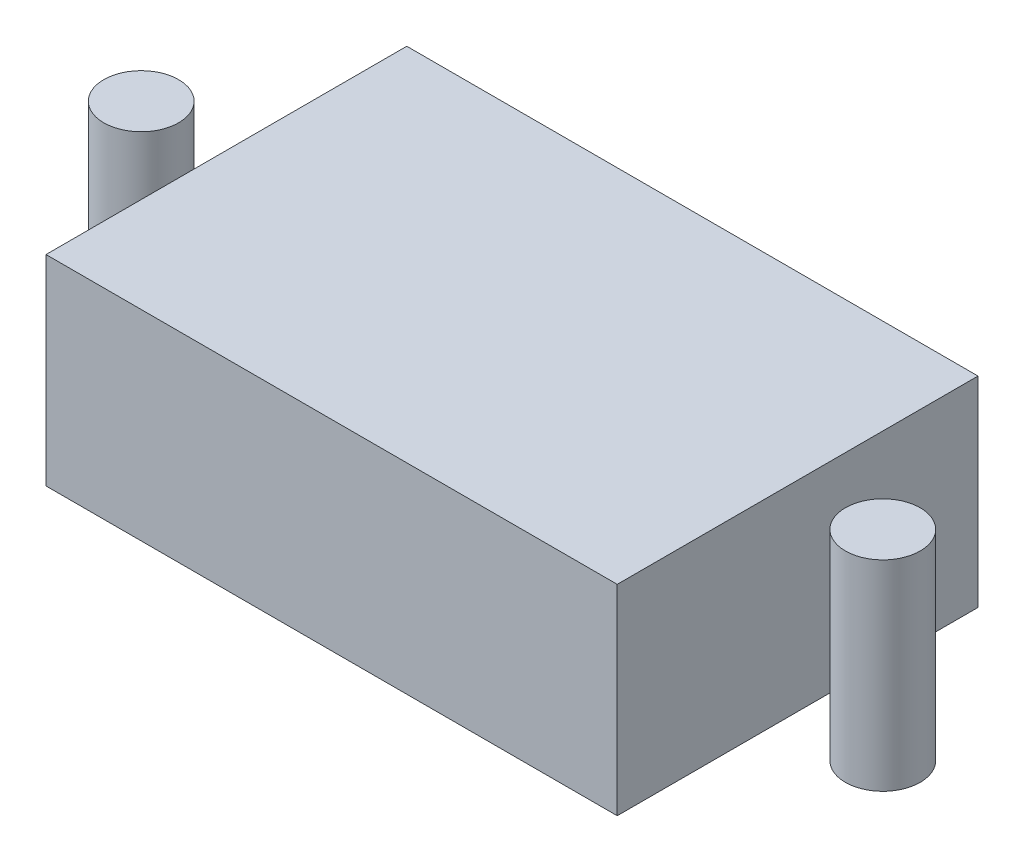
ISO-10303-21;
HEADER;
FILE_DESCRIPTION(('STEP AP214'),'2;1');
FILE_NAME('part.step','',(''),(''),'','','');
FILE_SCHEMA(('AUTOMOTIVE_DESIGN { 1 0 10303 214 1 1 1 1 }'));
ENDSEC;
DATA;
#1=APPLICATION_CONTEXT('core data for automotive mechanical design processes');
#2=APPLICATION_PROTOCOL_DEFINITION('international standard','automotive_design',2000,#1);
#3=PRODUCT_CONTEXT('',#1,'mechanical');
#4=PRODUCT('Part','Part','',(#3));
#5=PRODUCT_RELATED_PRODUCT_CATEGORY('part','',(#4));
#6=PRODUCT_DEFINITION_FORMATION('','',#4);
#7=PRODUCT_DEFINITION_CONTEXT('part definition',#1,'design');
#8=PRODUCT_DEFINITION('design','',#6,#7);
#9=PRODUCT_DEFINITION_SHAPE('','',#8);
#10=(LENGTH_UNIT() NAMED_UNIT(*) SI_UNIT(.MILLI.,.METRE.));
#11=(NAMED_UNIT(*) PLANE_ANGLE_UNIT() SI_UNIT($,.RADIAN.));
#12=(NAMED_UNIT(*) SI_UNIT($,.STERADIAN.) SOLID_ANGLE_UNIT());
#13=UNCERTAINTY_MEASURE_WITH_UNIT(LENGTH_MEASURE(1.E-05),#10,'distance_accuracy_value','');
#14=(GEOMETRIC_REPRESENTATION_CONTEXT(3) GLOBAL_UNCERTAINTY_ASSIGNED_CONTEXT((#13)) GLOBAL_UNIT_ASSIGNED_CONTEXT((#10,
#11,#12)) REPRESENTATION_CONTEXT('',''));
#15=CARTESIAN_POINT('',(0.,0.,0.));
#16=DIRECTION('',(0.,0.,1.));
#17=DIRECTION('',(1.,0.,0.));
#18=AXIS2_PLACEMENT_3D('',#15,#16,#17);
#19=CARTESIAN_POINT('',(14.25,10.,9.));
#20=DIRECTION('',(-1.,0.,0.));
#21=DIRECTION('',(0.,0.,1.));
#22=AXIS2_PLACEMENT_3D('',#19,#20,#21);
#23=PLANE('',#22);
#24=DIRECTION('',(0.,0.,-1.));
#25=VECTOR('',#24,1.);
#26=CARTESIAN_POINT('',(14.25,0.,9.));
#27=LINE('',#26,#25);
#28=CARTESIAN_POINT('',(14.25,0.,9.));
#29=VERTEX_POINT('',#28);
#30=CARTESIAN_POINT('',(14.25,0.,-9.));
#31=VERTEX_POINT('',#30);
#32=EDGE_CURVE('E108',#29,#31,#27,.T.);
#33=ORIENTED_EDGE('',*,*,#32,.T.);
#34=DIRECTION('',(0.,-1.,0.));
#35=VECTOR('',#34,1.);
#36=CARTESIAN_POINT('',(14.25,10.,-9.));
#37=LINE('',#36,#35);
#38=CARTESIAN_POINT('',(14.25,10.,-9.));
#39=VERTEX_POINT('',#38);
#40=EDGE_CURVE('E12',#39,#31,#37,.T.);
#41=ORIENTED_EDGE('',*,*,#40,.F.);
#42=DIRECTION('',(0.,0.,-1.));
#43=VECTOR('',#42,1.);
#44=CARTESIAN_POINT('',(14.25,10.,9.));
#45=LINE('',#44,#43);
#46=CARTESIAN_POINT('',(14.25,10.,9.));
#47=VERTEX_POINT('',#46);
#48=EDGE_CURVE('E96',#47,#39,#45,.T.);
#49=ORIENTED_EDGE('',*,*,#48,.F.);
#50=DIRECTION('',(0.,-1.,0.));
#51=VECTOR('',#50,1.);
#52=CARTESIAN_POINT('',(14.25,10.,9.));
#53=LINE('',#52,#51);
#54=EDGE_CURVE('E104',#47,#29,#53,.T.);
#55=ORIENTED_EDGE('',*,*,#54,.T.);
#56=EDGE_LOOP('',(#33,#41,#49,#55));
#57=FACE_BOUND('',#56,.T.);
#58=ADVANCED_FACE('F45',(#57),#23,.F.);
#59=CARTESIAN_POINT('',(-14.25,10.,-9.));
#60=DIRECTION('',(0.,0.,1.));
#61=DIRECTION('',(1.,0.,0.));
#62=AXIS2_PLACEMENT_3D('',#59,#60,#61);
#63=PLANE('',#62);
#64=DIRECTION('',(-1.,0.,0.));
#65=VECTOR('',#64,1.);
#66=CARTESIAN_POINT('',(-14.25,0.,-9.));
#67=LINE('',#66,#65);
#68=CARTESIAN_POINT('',(-14.25,0.,-9.));
#69=VERTEX_POINT('',#68);
#70=EDGE_CURVE('E100',#31,#69,#67,.T.);
#71=ORIENTED_EDGE('',*,*,#70,.T.);
#72=DIRECTION('',(0.,-1.,0.));
#73=VECTOR('',#72,1.);
#74=CARTESIAN_POINT('',(-14.25,10.,-9.));
#75=LINE('',#74,#73);
#76=CARTESIAN_POINT('',(-14.25,10.,-9.));
#77=VERTEX_POINT('',#76);
#78=EDGE_CURVE('E53',#77,#69,#75,.T.);
#79=ORIENTED_EDGE('',*,*,#78,.F.);
#80=DIRECTION('',(-1.,0.,0.));
#81=VECTOR('',#80,1.);
#82=CARTESIAN_POINT('',(-14.25,10.,-9.));
#83=LINE('',#82,#81);
#84=EDGE_CURVE('E91',#39,#77,#83,.T.);
#85=ORIENTED_EDGE('',*,*,#84,.F.);
#86=ORIENTED_EDGE('',*,*,#40,.T.);
#87=EDGE_LOOP('',(#71,#79,#85,#86));
#88=FACE_BOUND('',#87,.T.);
#89=ADVANCED_FACE('F99',(#88),#63,.F.);
#90=CARTESIAN_POINT('',(-14.25,10.,9.));
#91=DIRECTION('',(1.,0.,0.));
#92=DIRECTION('',(0.,0.,-1.));
#93=AXIS2_PLACEMENT_3D('',#90,#91,#92);
#94=PLANE('',#93);
#95=DIRECTION('',(0.,0.,1.));
#96=VECTOR('',#95,1.);
#97=CARTESIAN_POINT('',(-14.25,0.,9.));
#98=LINE('',#97,#96);
#99=CARTESIAN_POINT('',(-14.25,0.,9.));
#100=VERTEX_POINT('',#99);
#101=EDGE_CURVE('E78',#69,#100,#98,.T.);
#102=ORIENTED_EDGE('',*,*,#101,.T.);
#103=DIRECTION('',(0.,-1.,0.));
#104=VECTOR('',#103,1.);
#105=CARTESIAN_POINT('',(-14.25,10.,9.));
#106=LINE('',#105,#104);
#107=CARTESIAN_POINT('',(-14.25,10.,9.));
#108=VERTEX_POINT('',#107);
#109=EDGE_CURVE('E101',#108,#100,#106,.T.);
#110=ORIENTED_EDGE('',*,*,#109,.F.);
#111=DIRECTION('',(0.,0.,1.));
#112=VECTOR('',#111,1.);
#113=CARTESIAN_POINT('',(-14.25,10.,9.));
#114=LINE('',#113,#112);
#115=EDGE_CURVE('E94',#77,#108,#114,.T.);
#116=ORIENTED_EDGE('',*,*,#115,.F.);
#117=ORIENTED_EDGE('',*,*,#78,.T.);
#118=EDGE_LOOP('',(#102,#110,#116,#117));
#119=FACE_BOUND('',#118,.T.);
#120=ADVANCED_FACE('F102',(#119),#94,.F.);
#121=CARTESIAN_POINT('',(-14.25,10.,9.));
#122=DIRECTION('',(0.,0.,-1.));
#123=DIRECTION('',(-1.,0.,0.));
#124=AXIS2_PLACEMENT_3D('',#121,#122,#123);
#125=PLANE('',#124);
#126=DIRECTION('',(1.,0.,0.));
#127=VECTOR('',#126,1.);
#128=CARTESIAN_POINT('',(-14.25,0.,9.));
#129=LINE('',#128,#127);
#130=EDGE_CURVE('E84',#100,#29,#129,.T.);
#131=ORIENTED_EDGE('',*,*,#130,.T.);
#132=ORIENTED_EDGE('',*,*,#54,.F.);
#133=DIRECTION('',(1.,0.,0.));
#134=VECTOR('',#133,1.);
#135=CARTESIAN_POINT('',(-14.25,10.,9.));
#136=LINE('',#135,#134);
#137=EDGE_CURVE('E61',#108,#47,#136,.T.);
#138=ORIENTED_EDGE('',*,*,#137,.F.);
#139=ORIENTED_EDGE('',*,*,#109,.T.);
#140=EDGE_LOOP('',(#131,#132,#138,#139));
#141=FACE_BOUND('',#140,.T.);
#142=ADVANCED_FACE('F115',(#141),#125,.F.);
#143=CARTESIAN_POINT('',(0.,10.,0.));
#144=DIRECTION('',(0.,-1.,0.));
#145=DIRECTION('',(0.,0.,-1.));
#146=AXIS2_PLACEMENT_3D('',#143,#144,#145);
#147=PLANE('',#146);
#148=ORIENTED_EDGE('',*,*,#48,.T.);
#149=ORIENTED_EDGE('',*,*,#84,.T.);
#150=ORIENTED_EDGE('',*,*,#115,.T.);
#151=ORIENTED_EDGE('',*,*,#137,.T.);
#152=EDGE_LOOP('',(#148,#149,#150,#151));
#153=FACE_BOUND('',#152,.T.);
#154=ADVANCED_FACE('F92',(#153),#147,.F.);
#155=CARTESIAN_POINT('',(0.,0.,0.));
#156=DIRECTION('',(0.,-1.,0.));
#157=DIRECTION('',(0.,0.,-1.));
#158=AXIS2_PLACEMENT_3D('',#155,#156,#157);
#159=PLANE('',#158);
#160=ORIENTED_EDGE('',*,*,#32,.F.);
#161=ORIENTED_EDGE('',*,*,#130,.F.);
#162=ORIENTED_EDGE('',*,*,#101,.F.);
#163=ORIENTED_EDGE('',*,*,#70,.F.);
#164=EDGE_LOOP('',(#160,#161,#162,#163));
#165=FACE_BOUND('',#164,.T.);
#166=ADVANCED_FACE('F118',(#165),#159,.T.);
#167=CLOSED_SHELL('',(#58,#89,#120,#142,#154,#166));
#168=MANIFOLD_SOLID_BREP('B2',#167);
#169=CARTESIAN_POINT('',(-18.5,10.,0.));
#170=DIRECTION('',(0.,-1.,0.));
#171=DIRECTION('',(0.,0.,-1.));
#172=AXIS2_PLACEMENT_3D('',#169,#170,#171);
#173=CYLINDRICAL_SURFACE('',#172,1.8669);
#174=CARTESIAN_POINT('',(-18.5,10.,0.));
#175=DIRECTION('',(0.,1.,0.));
#176=DIRECTION('',(0.,0.,1.));
#177=AXIS2_PLACEMENT_3D('',#174,#175,#176);
#178=CIRCLE('',#177,1.8669);
#179=CARTESIAN_POINT('',(-18.5,10.,1.8669));
#180=VERTEX_POINT('',#179);
#181=EDGE_CURVE('E44',#180,#180,#178,.T.);
#182=ORIENTED_EDGE('',*,*,#181,.F.);
#183=EDGE_LOOP('',(#182));
#184=FACE_BOUND('',#183,.T.);
#185=CARTESIAN_POINT('',(-18.5,0.,0.));
#186=DIRECTION('',(0.,1.,0.));
#187=DIRECTION('',(0.,0.,1.));
#188=AXIS2_PLACEMENT_3D('',#185,#186,#187);
#189=CIRCLE('',#188,1.8669);
#190=CARTESIAN_POINT('',(-18.5,0.,1.8669));
#191=VERTEX_POINT('',#190);
#192=EDGE_CURVE('E178',#191,#191,#189,.T.);
#193=ORIENTED_EDGE('',*,*,#192,.T.);
#194=EDGE_LOOP('',(#193));
#195=FACE_BOUND('',#194,.T.);
#196=ADVANCED_FACE('F175',(#184,#195),#173,.T.);
#197=CARTESIAN_POINT('',(-18.5,10.,0.));
#198=DIRECTION('',(0.,1.,0.));
#199=DIRECTION('',(0.,0.,1.));
#200=AXIS2_PLACEMENT_3D('',#197,#198,#199);
#201=PLANE('',#200);
#202=ORIENTED_EDGE('',*,*,#181,.T.);
#203=EDGE_LOOP('',(#202));
#204=FACE_BOUND('',#203,.T.);
#205=ADVANCED_FACE('F190',(#204),#201,.T.);
#206=CARTESIAN_POINT('',(-18.5,0.,0.));
#207=DIRECTION('',(0.,1.,0.));
#208=DIRECTION('',(0.,0.,1.));
#209=AXIS2_PLACEMENT_3D('',#206,#207,#208);
#210=PLANE('',#209);
#211=ORIENTED_EDGE('',*,*,#192,.F.);
#212=EDGE_LOOP('',(#211));
#213=FACE_BOUND('',#212,.T.);
#214=ADVANCED_FACE('F188',(#213),#210,.F.);
#215=CLOSED_SHELL('',(#196,#205,#214));
#216=MANIFOLD_SOLID_BREP('B6',#215);
#217=CARTESIAN_POINT('',(18.5,10.,0.));
#218=DIRECTION('',(0.,-1.,0.));
#219=DIRECTION('',(0.,0.,-1.));
#220=AXIS2_PLACEMENT_3D('',#217,#218,#219);
#221=CYLINDRICAL_SURFACE('',#220,1.8669);
#222=CARTESIAN_POINT('',(18.5,10.,0.));
#223=DIRECTION('',(0.,1.,0.));
#224=DIRECTION('',(0.,0.,1.));
#225=AXIS2_PLACEMENT_3D('',#222,#223,#224);
#226=CIRCLE('',#225,1.8669);
#227=CARTESIAN_POINT('',(18.5,10.,1.8669));
#228=VERTEX_POINT('',#227);
#229=EDGE_CURVE('E174',#228,#228,#226,.T.);
#230=ORIENTED_EDGE('',*,*,#229,.F.);
#231=EDGE_LOOP('',(#230));
#232=FACE_BOUND('',#231,.T.);
#233=CARTESIAN_POINT('',(18.5,0.,0.));
#234=DIRECTION('',(0.,1.,0.));
#235=DIRECTION('',(0.,0.,1.));
#236=AXIS2_PLACEMENT_3D('',#233,#234,#235);
#237=CIRCLE('',#236,1.8669);
#238=CARTESIAN_POINT('',(18.5,0.,1.8669));
#239=VERTEX_POINT('',#238);
#240=EDGE_CURVE('E218',#239,#239,#237,.T.);
#241=ORIENTED_EDGE('',*,*,#240,.T.);
#242=EDGE_LOOP('',(#241));
#243=FACE_BOUND('',#242,.T.);
#244=ADVANCED_FACE('F215',(#232,#243),#221,.T.);
#245=CARTESIAN_POINT('',(18.5,10.,0.));
#246=DIRECTION('',(0.,1.,0.));
#247=DIRECTION('',(0.,0.,1.));
#248=AXIS2_PLACEMENT_3D('',#245,#246,#247);
#249=PLANE('',#248);
#250=ORIENTED_EDGE('',*,*,#229,.T.);
#251=EDGE_LOOP('',(#250));
#252=FACE_BOUND('',#251,.T.);
#253=ADVANCED_FACE('F230',(#252),#249,.T.);
#254=CARTESIAN_POINT('',(18.5,0.,0.));
#255=DIRECTION('',(0.,1.,0.));
#256=DIRECTION('',(0.,0.,1.));
#257=AXIS2_PLACEMENT_3D('',#254,#255,#256);
#258=PLANE('',#257);
#259=ORIENTED_EDGE('',*,*,#240,.F.);
#260=EDGE_LOOP('',(#259));
#261=FACE_BOUND('',#260,.T.);
#262=ADVANCED_FACE('F228',(#261),#258,.F.);
#263=CLOSED_SHELL('',(#244,#253,#262));
#264=MANIFOLD_SOLID_BREP('B39',#263);
#265=ADVANCED_BREP_SHAPE_REPRESENTATION('',(#18,#168,#216,#264),#14);
#266=SHAPE_DEFINITION_REPRESENTATION(#9,#265);
ENDSEC;
END-ISO-10303-21;
